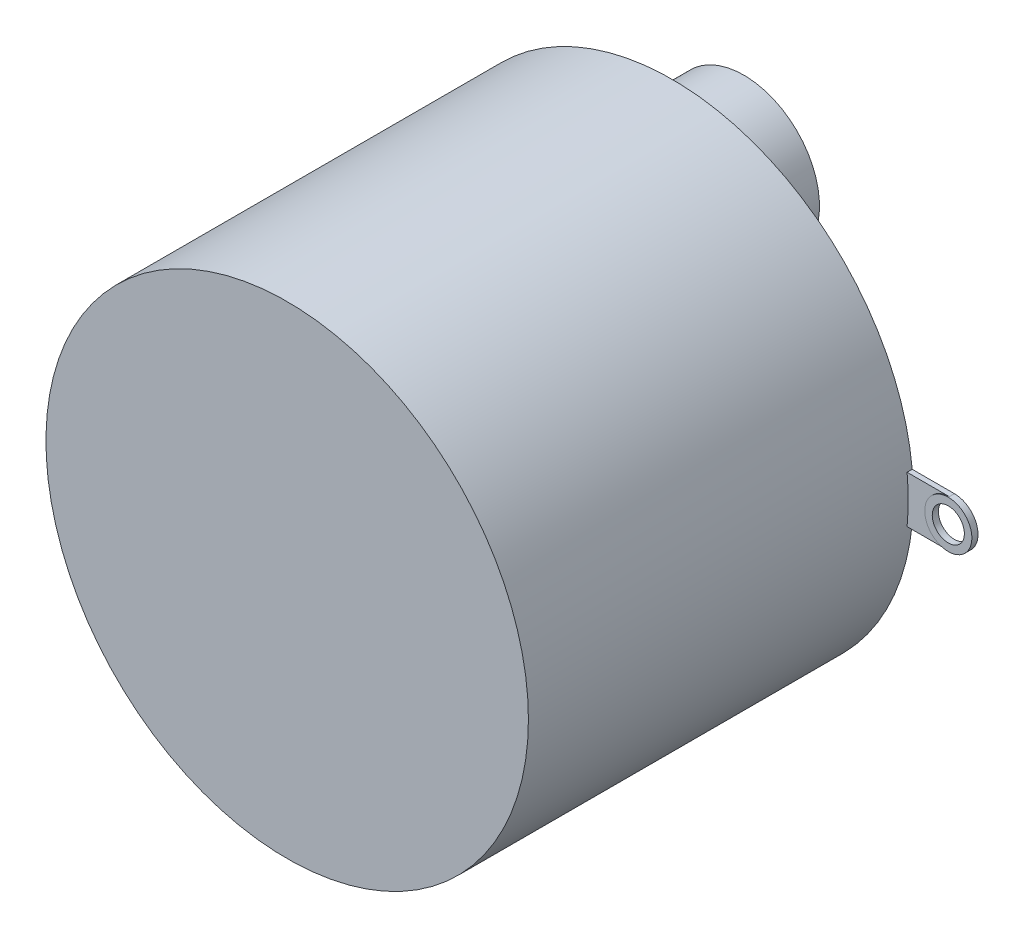
ISO-10303-21;
HEADER;
FILE_DESCRIPTION(('STEP AP214'),'2;1');
FILE_NAME('part.step','',(''),(''),'','','');
FILE_SCHEMA(('AUTOMOTIVE_DESIGN { 1 0 10303 214 1 1 1 1 }'));
ENDSEC;
DATA;
#1=APPLICATION_CONTEXT('core data for automotive mechanical design processes');
#2=APPLICATION_PROTOCOL_DEFINITION('international standard','automotive_design',2000,#1);
#3=PRODUCT_CONTEXT('',#1,'mechanical');
#4=PRODUCT('Part','Part','',(#3));
#5=PRODUCT_RELATED_PRODUCT_CATEGORY('part','',(#4));
#6=PRODUCT_DEFINITION_FORMATION('','',#4);
#7=PRODUCT_DEFINITION_CONTEXT('part definition',#1,'design');
#8=PRODUCT_DEFINITION('design','',#6,#7);
#9=PRODUCT_DEFINITION_SHAPE('','',#8);
#10=(LENGTH_UNIT() NAMED_UNIT(*) SI_UNIT(.MILLI.,.METRE.));
#11=(NAMED_UNIT(*) PLANE_ANGLE_UNIT() SI_UNIT($,.RADIAN.));
#12=(NAMED_UNIT(*) SI_UNIT($,.STERADIAN.) SOLID_ANGLE_UNIT());
#13=UNCERTAINTY_MEASURE_WITH_UNIT(LENGTH_MEASURE(1.E-05),#10,'distance_accuracy_value','');
#14=(GEOMETRIC_REPRESENTATION_CONTEXT(3) GLOBAL_UNCERTAINTY_ASSIGNED_CONTEXT((#13)) GLOBAL_UNIT_ASSIGNED_CONTEXT((#10,
#11,#12)) REPRESENTATION_CONTEXT('',''));
#15=CARTESIAN_POINT('',(0.,0.,0.));
#16=DIRECTION('',(0.,0.,1.));
#17=DIRECTION('',(1.,0.,0.));
#18=AXIS2_PLACEMENT_3D('',#15,#16,#17);
#19=CARTESIAN_POINT('',(0.,0.,19.05));
#20=DIRECTION('',(0.,0.,-1.));
#21=DIRECTION('',(-1.,0.,0.));
#22=AXIS2_PLACEMENT_3D('',#19,#20,#21);
#23=CYLINDRICAL_SURFACE('',#22,11.938);
#24=CARTESIAN_POINT('',(0.,0.,0.253999999999997));
#25=DIRECTION('',(0.,0.,-1.));
#26=DIRECTION('',(-1.,0.,0.));
#27=AXIS2_PLACEMENT_3D('',#24,#25,#26);
#28=CIRCLE('',#27,11.938);
#29=CARTESIAN_POINT('',(11.881000665905,1.1651897599816,0.253999999999997));
#30=VERTEX_POINT('',#29);
#31=CARTESIAN_POINT('',(11.881000665905,-1.1651897599816,0.253999999999997));
#32=VERTEX_POINT('',#31);
#33=EDGE_CURVE('E161',#30,#32,#28,.T.);
#34=ORIENTED_EDGE('',*,*,#33,.F.);
#35=DIRECTION('',(0.,0.,-1.));
#36=VECTOR('',#35,1.);
#37=CARTESIAN_POINT('',(11.881000665905,1.1651897599816,19.05));
#38=LINE('',#37,#36);
#39=CARTESIAN_POINT('',(11.881000665905,1.1651897599816,0.));
#40=VERTEX_POINT('',#39);
#41=EDGE_CURVE('E149',#30,#40,#38,.T.);
#42=ORIENTED_EDGE('',*,*,#41,.T.);
#43=CARTESIAN_POINT('',(0.,0.,0.));
#44=DIRECTION('',(0.,0.,1.));
#45=DIRECTION('',(1.,0.,0.));
#46=AXIS2_PLACEMENT_3D('',#43,#44,#45);
#47=CIRCLE('',#46,11.938);
#48=CARTESIAN_POINT('',(-11.881000665905,1.1651897599816,0.));
#49=VERTEX_POINT('',#48);
#50=EDGE_CURVE('E156',#40,#49,#47,.T.);
#51=ORIENTED_EDGE('',*,*,#50,.T.);
#52=DIRECTION('',(0.,0.,-1.));
#53=VECTOR('',#52,1.);
#54=CARTESIAN_POINT('',(-11.881000665905,1.1651897599816,19.05));
#55=LINE('',#54,#53);
#56=CARTESIAN_POINT('',(-11.881000665905,1.1651897599816,0.253999999999997));
#57=VERTEX_POINT('',#56);
#58=EDGE_CURVE('E146',#49,#57,#55,.F.);
#59=ORIENTED_EDGE('',*,*,#58,.T.);
#60=CARTESIAN_POINT('',(-11.881000665905,-1.1651897599816,0.253999999999997));
#61=VERTEX_POINT('',#60);
#62=EDGE_CURVE('E155',#61,#57,#28,.T.);
#63=ORIENTED_EDGE('',*,*,#62,.F.);
#64=DIRECTION('',(0.,0.,-1.));
#65=VECTOR('',#64,1.);
#66=CARTESIAN_POINT('',(-11.881000665905,-1.1651897599816,19.05));
#67=LINE('',#66,#65);
#68=CARTESIAN_POINT('',(-11.881000665905,-1.1651897599816,0.));
#69=VERTEX_POINT('',#68);
#70=EDGE_CURVE('E144',#61,#69,#67,.T.);
#71=ORIENTED_EDGE('',*,*,#70,.T.);
#72=CARTESIAN_POINT('',(11.881000665905,-1.1651897599816,0.));
#73=VERTEX_POINT('',#72);
#74=EDGE_CURVE('E122',#69,#73,#47,.T.);
#75=ORIENTED_EDGE('',*,*,#74,.T.);
#76=DIRECTION('',(0.,0.,-1.));
#77=VECTOR('',#76,1.);
#78=CARTESIAN_POINT('',(11.881000665905,-1.1651897599816,19.05));
#79=LINE('',#78,#77);
#80=EDGE_CURVE('E59',#73,#32,#79,.F.);
#81=ORIENTED_EDGE('',*,*,#80,.T.);
#82=EDGE_LOOP('',(#34,#42,#51,#59,#63,#71,#75,#81));
#83=FACE_BOUND('',#82,.T.);
#84=CARTESIAN_POINT('',(0.,0.,19.05));
#85=DIRECTION('',(0.,0.,1.));
#86=DIRECTION('',(1.,0.,0.));
#87=AXIS2_PLACEMENT_3D('',#84,#85,#86);
#88=CIRCLE('',#87,11.938);
#89=CARTESIAN_POINT('',(11.938,0.,19.05));
#90=VERTEX_POINT('',#89);
#91=EDGE_CURVE('E152',#90,#90,#88,.T.);
#92=ORIENTED_EDGE('',*,*,#91,.F.);
#93=EDGE_LOOP('',(#92));
#94=FACE_BOUND('',#93,.T.);
#95=ADVANCED_FACE('F37',(#83,#94),#23,.T.);
#96=CARTESIAN_POINT('',(0.,0.,19.05));
#97=DIRECTION('',(0.,0.,1.));
#98=DIRECTION('',(1.,0.,0.));
#99=AXIS2_PLACEMENT_3D('',#96,#97,#98);
#100=PLANE('',#99);
#101=ORIENTED_EDGE('',*,*,#91,.T.);
#102=EDGE_LOOP('',(#101));
#103=FACE_BOUND('',#102,.T.);
#104=ADVANCED_FACE('F213',(#103),#100,.T.);
#105=CARTESIAN_POINT('',(0.,0.,0.));
#106=DIRECTION('',(0.,0.,1.));
#107=DIRECTION('',(1.,0.,0.));
#108=AXIS2_PLACEMENT_3D('',#105,#106,#107);
#109=PLANE('',#108);
#110=CARTESIAN_POINT('',(0.,6.604,0.));
#111=DIRECTION('',(0.,0.,1.));
#112=DIRECTION('',(1.,0.,0.));
#113=AXIS2_PLACEMENT_3D('',#110,#111,#112);
#114=CIRCLE('',#113,0.470774680139313);
#115=CARTESIAN_POINT('',(0.470774680139313,6.604,0.));
#116=VERTEX_POINT('',#115);
#117=EDGE_CURVE('E11',#116,#116,#114,.F.);
#118=ORIENTED_EDGE('',*,*,#117,.F.);
#119=EDGE_LOOP('',(#118));
#120=FACE_BOUND('',#119,.T.);
#121=CARTESIAN_POINT('',(-13.97,0.,0.));
#122=DIRECTION('',(0.,0.,-1.));
#123=DIRECTION('',(-1.,0.,0.));
#124=AXIS2_PLACEMENT_3D('',#121,#122,#123);
#125=CIRCLE('',#124,0.753950062625306);
#126=CARTESIAN_POINT('',(-14.7239500626253,0.,0.));
#127=VERTEX_POINT('',#126);
#128=EDGE_CURVE('E167',#127,#127,#125,.T.);
#129=ORIENTED_EDGE('',*,*,#128,.F.);
#130=EDGE_LOOP('',(#129));
#131=FACE_BOUND('',#130,.T.);
#132=CARTESIAN_POINT('',(13.97,0.,0.));
#133=DIRECTION('',(0.,0.,-1.));
#134=DIRECTION('',(-1.,0.,0.));
#135=AXIS2_PLACEMENT_3D('',#132,#133,#134);
#136=CIRCLE('',#135,0.795236376755501);
#137=CARTESIAN_POINT('',(13.1747636232445,0.,0.));
#138=VERTEX_POINT('',#137);
#139=EDGE_CURVE('E164',#138,#138,#136,.T.);
#140=ORIENTED_EDGE('',*,*,#139,.F.);
#141=EDGE_LOOP('',(#140));
#142=FACE_BOUND('',#141,.T.);
#143=DIRECTION('',(-1.,0.,0.));
#144=VECTOR('',#143,1.);
#145=CARTESIAN_POINT('',(13.97,-1.1651897599816,0.));
#146=LINE('',#145,#144);
#147=CARTESIAN_POINT('',(-13.800047892177,-1.1651897599816,0.));
#148=VERTEX_POINT('',#147);
#149=EDGE_CURVE('E114',#69,#148,#146,.T.);
#150=ORIENTED_EDGE('',*,*,#149,.T.);
#151=CARTESIAN_POINT('',(-13.97,0.,0.));
#152=DIRECTION('',(0.,0.,-1.));
#153=DIRECTION('',(-1.,0.,0.));
#154=AXIS2_PLACEMENT_3D('',#151,#152,#153);
#155=CIRCLE('',#154,1.17751895769006);
#156=CARTESIAN_POINT('',(-13.8000478921769,1.1651897599816,0.));
#157=VERTEX_POINT('',#156);
#158=EDGE_CURVE('E51',#148,#157,#155,.T.);
#159=ORIENTED_EDGE('',*,*,#158,.T.);
#160=DIRECTION('',(1.,0.,0.));
#161=VECTOR('',#160,1.);
#162=CARTESIAN_POINT('',(13.97,1.1651897599816,0.));
#163=LINE('',#162,#161);
#164=EDGE_CURVE('E135',#157,#49,#163,.T.);
#165=ORIENTED_EDGE('',*,*,#164,.T.);
#166=ORIENTED_EDGE('',*,*,#50,.F.);
#167=CARTESIAN_POINT('',(13.97,1.1651897599816,0.));
#168=VERTEX_POINT('',#167);
#169=EDGE_CURVE('E127',#40,#168,#163,.T.);
#170=ORIENTED_EDGE('',*,*,#169,.T.);
#171=CARTESIAN_POINT('',(13.97,0.,0.));
#172=DIRECTION('',(0.,0.,-1.));
#173=DIRECTION('',(-1.,0.,0.));
#174=AXIS2_PLACEMENT_3D('',#171,#172,#173);
#175=CIRCLE('',#174,1.1651897599816);
#176=CARTESIAN_POINT('',(13.97,-1.1651897599816,0.));
#177=VERTEX_POINT('',#176);
#178=EDGE_CURVE('E117',#168,#177,#175,.T.);
#179=ORIENTED_EDGE('',*,*,#178,.T.);
#180=EDGE_CURVE('E124',#177,#73,#146,.T.);
#181=ORIENTED_EDGE('',*,*,#180,.T.);
#182=ORIENTED_EDGE('',*,*,#74,.F.);
#183=EDGE_LOOP('',(#150,#159,#165,#166,#170,#179,#181,#182));
#184=FACE_BOUND('',#183,.T.);
#185=ADVANCED_FACE('F120',(#120,#131,#142,#184),#109,.F.);
#186=CARTESIAN_POINT('',(0.,0.,0.253999999999998));
#187=DIRECTION('',(0.,0.,-1.));
#188=DIRECTION('',(-1.,0.,0.));
#189=AXIS2_PLACEMENT_3D('',#186,#187,#188);
#190=PLANE('',#189);
#191=DIRECTION('',(1.,0.,0.));
#192=VECTOR('',#191,1.);
#193=CARTESIAN_POINT('',(13.97,1.1651897599816,0.253999999999998));
#194=LINE('',#193,#192);
#195=CARTESIAN_POINT('',(-13.8000478921769,1.1651897599816,0.253999999999998));
#196=VERTEX_POINT('',#195);
#197=EDGE_CURVE('E133',#196,#57,#194,.T.);
#198=ORIENTED_EDGE('',*,*,#197,.F.);
#199=CARTESIAN_POINT('',(-13.97,0.,0.253999999999998));
#200=DIRECTION('',(0.,0.,-1.));
#201=DIRECTION('',(-1.,0.,0.));
#202=AXIS2_PLACEMENT_3D('',#199,#200,#201);
#203=CIRCLE('',#202,1.17751895769006);
#204=CARTESIAN_POINT('',(-13.800047892177,-1.1651897599816,0.253999999999998));
#205=VERTEX_POINT('',#204);
#206=EDGE_CURVE('E118',#196,#205,#203,.T.);
#207=ORIENTED_EDGE('',*,*,#206,.T.);
#208=DIRECTION('',(-1.,0.,0.));
#209=VECTOR('',#208,1.);
#210=CARTESIAN_POINT('',(13.97,-1.1651897599816,0.253999999999998));
#211=LINE('',#210,#209);
#212=EDGE_CURVE('E116',#61,#205,#211,.T.);
#213=ORIENTED_EDGE('',*,*,#212,.F.);
#214=ORIENTED_EDGE('',*,*,#62,.T.);
#215=EDGE_LOOP('',(#198,#207,#213,#214));
#216=FACE_BOUND('',#215,.T.);
#217=ADVANCED_FACE('F203',(#216),#190,.F.);
#218=CARTESIAN_POINT('',(13.97,-1.1651897599816,0.253999999999998));
#219=DIRECTION('',(0.,-1.,0.));
#220=DIRECTION('',(0.,0.,-1.));
#221=AXIS2_PLACEMENT_3D('',#218,#219,#220);
#222=PLANE('',#221);
#223=DIRECTION('',(0.,0.,-1.));
#224=VECTOR('',#223,1.);
#225=CARTESIAN_POINT('',(-13.800047892177,-1.1651897599816,0.304204724435391));
#226=LINE('',#225,#224);
#227=EDGE_CURVE('E102',#148,#205,#226,.F.);
#228=ORIENTED_EDGE('',*,*,#227,.F.);
#229=ORIENTED_EDGE('',*,*,#149,.F.);
#230=ORIENTED_EDGE('',*,*,#70,.F.);
#231=ORIENTED_EDGE('',*,*,#212,.T.);
#232=EDGE_LOOP('',(#228,#229,#230,#231));
#233=FACE_BOUND('',#232,.T.);
#234=ADVANCED_FACE('F112',(#233),#222,.T.);
#235=CARTESIAN_POINT('',(13.97,1.1651897599816,0.253999999999998));
#236=DIRECTION('',(0.,1.,0.));
#237=DIRECTION('',(0.,0.,1.));
#238=AXIS2_PLACEMENT_3D('',#235,#236,#237);
#239=PLANE('',#238);
#240=DIRECTION('',(0.,0.,-1.));
#241=VECTOR('',#240,1.);
#242=CARTESIAN_POINT('',(-13.8000478921769,1.1651897599816,0.304204724435391));
#243=LINE('',#242,#241);
#244=EDGE_CURVE('E44',#196,#157,#243,.T.);
#245=ORIENTED_EDGE('',*,*,#244,.F.);
#246=ORIENTED_EDGE('',*,*,#197,.T.);
#247=ORIENTED_EDGE('',*,*,#58,.F.);
#248=ORIENTED_EDGE('',*,*,#164,.F.);
#249=EDGE_LOOP('',(#245,#246,#247,#248));
#250=FACE_BOUND('',#249,.T.);
#251=ADVANCED_FACE('F200',(#250),#239,.T.);
#252=CARTESIAN_POINT('',(13.97,-1.1651897599816,0.253999999999998));
#253=VERTEX_POINT('',#252);
#254=EDGE_CURVE('E187',#253,#32,#211,.T.);
#255=ORIENTED_EDGE('',*,*,#254,.F.);
#256=CARTESIAN_POINT('',(13.97,0.,0.253999999999998));
#257=DIRECTION('',(0.,0.,-1.));
#258=DIRECTION('',(-1.,0.,0.));
#259=AXIS2_PLACEMENT_3D('',#256,#257,#258);
#260=CIRCLE('',#259,1.1651897599816);
#261=CARTESIAN_POINT('',(13.97,1.1651897599816,0.253999999999998));
#262=VERTEX_POINT('',#261);
#263=EDGE_CURVE('E125',#253,#262,#260,.T.);
#264=ORIENTED_EDGE('',*,*,#263,.T.);
#265=EDGE_CURVE('E189',#30,#262,#194,.T.);
#266=ORIENTED_EDGE('',*,*,#265,.F.);
#267=ORIENTED_EDGE('',*,*,#33,.T.);
#268=EDGE_LOOP('',(#255,#264,#266,#267));
#269=FACE_BOUND('',#268,.T.);
#270=ADVANCED_FACE('F206',(#269),#190,.F.);
#271=ORIENTED_EDGE('',*,*,#41,.F.);
#272=ORIENTED_EDGE('',*,*,#265,.T.);
#273=DIRECTION('',(0.,0.,-1.));
#274=VECTOR('',#273,1.);
#275=CARTESIAN_POINT('',(13.97,1.1651897599816,0.253999999999998));
#276=LINE('',#275,#274);
#277=EDGE_CURVE('E137',#262,#168,#276,.T.);
#278=ORIENTED_EDGE('',*,*,#277,.T.);
#279=ORIENTED_EDGE('',*,*,#169,.F.);
#280=EDGE_LOOP('',(#271,#272,#278,#279));
#281=FACE_BOUND('',#280,.T.);
#282=ADVANCED_FACE('F218',(#281),#239,.T.);
#283=ORIENTED_EDGE('',*,*,#80,.F.);
#284=ORIENTED_EDGE('',*,*,#180,.F.);
#285=DIRECTION('',(0.,0.,-1.));
#286=VECTOR('',#285,1.);
#287=CARTESIAN_POINT('',(13.97,-1.1651897599816,0.253999999999998));
#288=LINE('',#287,#286);
#289=EDGE_CURVE('E140',#253,#177,#288,.T.);
#290=ORIENTED_EDGE('',*,*,#289,.F.);
#291=ORIENTED_EDGE('',*,*,#254,.T.);
#292=EDGE_LOOP('',(#283,#284,#290,#291));
#293=FACE_BOUND('',#292,.T.);
#294=ADVANCED_FACE('F212',(#293),#222,.T.);
#295=CARTESIAN_POINT('',(13.97,0.,0.304204724435391));
#296=DIRECTION('',(0.,0.,-1.));
#297=DIRECTION('',(-1.,0.,0.));
#298=AXIS2_PLACEMENT_3D('',#295,#296,#297);
#299=CYLINDRICAL_SURFACE('',#298,1.1651897599816);
#300=CARTESIAN_POINT('',(13.97,0.,0.304204724435391));
#301=DIRECTION('',(0.,0.,-1.));
#302=DIRECTION('',(-1.,0.,0.));
#303=AXIS2_PLACEMENT_3D('',#300,#301,#302);
#304=CIRCLE('',#303,1.1651897599816);
#305=CARTESIAN_POINT('',(12.8048102400184,0.,0.304204724435391));
#306=VERTEX_POINT('',#305);
#307=EDGE_CURVE('E129',#306,#306,#304,.T.);
#308=ORIENTED_EDGE('',*,*,#307,.T.);
#309=EDGE_LOOP('',(#308));
#310=FACE_BOUND('',#309,.T.);
#311=ORIENTED_EDGE('',*,*,#263,.F.);
#312=ORIENTED_EDGE('',*,*,#289,.T.);
#313=ORIENTED_EDGE('',*,*,#178,.F.);
#314=ORIENTED_EDGE('',*,*,#277,.F.);
#315=EDGE_LOOP('',(#311,#312,#313,#314));
#316=FACE_BOUND('',#315,.T.);
#317=ADVANCED_FACE('F232',(#310,#316),#299,.T.);
#318=CARTESIAN_POINT('',(0.,0.,0.304204724435391));
#319=DIRECTION('',(0.,0.,-1.));
#320=DIRECTION('',(-1.,0.,0.));
#321=AXIS2_PLACEMENT_3D('',#318,#319,#320);
#322=PLANE('',#321);
#323=CARTESIAN_POINT('',(13.97,0.,0.304204724435391));
#324=DIRECTION('',(0.,0.,-1.));
#325=DIRECTION('',(-1.,0.,0.));
#326=AXIS2_PLACEMENT_3D('',#323,#324,#325);
#327=CIRCLE('',#326,0.795236376755501);
#328=CARTESIAN_POINT('',(13.1747636232445,0.,0.304204724435391));
#329=VERTEX_POINT('',#328);
#330=EDGE_CURVE('E107',#329,#329,#327,.T.);
#331=ORIENTED_EDGE('',*,*,#330,.T.);
#332=EDGE_LOOP('',(#331));
#333=FACE_BOUND('',#332,.T.);
#334=ORIENTED_EDGE('',*,*,#307,.F.);
#335=EDGE_LOOP('',(#334));
#336=FACE_BOUND('',#335,.T.);
#337=ADVANCED_FACE('F262',(#333,#336),#322,.F.);
#338=CARTESIAN_POINT('',(-13.97,0.,0.304204724435391));
#339=DIRECTION('',(0.,0.,-1.));
#340=DIRECTION('',(-1.,0.,0.));
#341=AXIS2_PLACEMENT_3D('',#338,#339,#340);
#342=CYLINDRICAL_SURFACE('',#341,1.17751895769006);
#343=ORIENTED_EDGE('',*,*,#244,.T.);
#344=ORIENTED_EDGE('',*,*,#158,.F.);
#345=ORIENTED_EDGE('',*,*,#227,.T.);
#346=ORIENTED_EDGE('',*,*,#206,.F.);
#347=EDGE_LOOP('',(#343,#344,#345,#346));
#348=FACE_BOUND('',#347,.T.);
#349=CARTESIAN_POINT('',(-13.97,0.,0.304204724435391));
#350=DIRECTION('',(0.,0.,-1.));
#351=DIRECTION('',(-1.,0.,0.));
#352=AXIS2_PLACEMENT_3D('',#349,#350,#351);
#353=CIRCLE('',#352,1.17751895769006);
#354=CARTESIAN_POINT('',(-15.1475189576901,0.,0.304204724435391));
#355=VERTEX_POINT('',#354);
#356=EDGE_CURVE('E106',#355,#355,#353,.T.);
#357=ORIENTED_EDGE('',*,*,#356,.T.);
#358=EDGE_LOOP('',(#357));
#359=FACE_BOUND('',#358,.T.);
#360=ADVANCED_FACE('F100',(#348,#359),#342,.T.);
#361=CARTESIAN_POINT('',(0.,0.,0.304204724435391));
#362=DIRECTION('',(0.,0.,-1.));
#363=DIRECTION('',(-1.,0.,0.));
#364=AXIS2_PLACEMENT_3D('',#361,#362,#363);
#365=PLANE('',#364);
#366=CARTESIAN_POINT('',(-13.97,0.,0.304204724435391));
#367=DIRECTION('',(0.,0.,-1.));
#368=DIRECTION('',(-1.,0.,0.));
#369=AXIS2_PLACEMENT_3D('',#366,#367,#368);
#370=CIRCLE('',#369,0.753950062625306);
#371=CARTESIAN_POINT('',(-14.7239500626253,0.,0.304204724435391));
#372=VERTEX_POINT('',#371);
#373=EDGE_CURVE('E165',#372,#372,#370,.T.);
#374=ORIENTED_EDGE('',*,*,#373,.T.);
#375=EDGE_LOOP('',(#374));
#376=FACE_BOUND('',#375,.T.);
#377=ORIENTED_EDGE('',*,*,#356,.F.);
#378=EDGE_LOOP('',(#377));
#379=FACE_BOUND('',#378,.T.);
#380=ADVANCED_FACE('F274',(#376,#379),#365,.F.);
#381=CARTESIAN_POINT('',(13.97,0.,0.90572007352387));
#382=DIRECTION('',(0.,0.,-1.));
#383=DIRECTION('',(-1.,0.,0.));
#384=AXIS2_PLACEMENT_3D('',#381,#382,#383);
#385=CYLINDRICAL_SURFACE('',#384,0.795236376755501);
#386=ORIENTED_EDGE('',*,*,#139,.T.);
#387=EDGE_LOOP('',(#386));
#388=FACE_BOUND('',#387,.T.);
#389=ORIENTED_EDGE('',*,*,#330,.F.);
#390=EDGE_LOOP('',(#389));
#391=FACE_BOUND('',#390,.T.);
#392=ADVANCED_FACE('F289',(#388,#391),#385,.F.);
#393=CARTESIAN_POINT('',(-13.97,0.,1.016));
#394=DIRECTION('',(0.,0.,-1.));
#395=DIRECTION('',(-1.,0.,0.));
#396=AXIS2_PLACEMENT_3D('',#393,#394,#395);
#397=CYLINDRICAL_SURFACE('',#396,0.753950062625306);
#398=ORIENTED_EDGE('',*,*,#128,.T.);
#399=EDGE_LOOP('',(#398));
#400=FACE_BOUND('',#399,.T.);
#401=ORIENTED_EDGE('',*,*,#373,.F.);
#402=EDGE_LOOP('',(#401));
#403=FACE_BOUND('',#402,.T.);
#404=ADVANCED_FACE('F293',(#400,#403),#397,.F.);
#405=CARTESIAN_POINT('',(0.,6.604,-0.245031324178737));
#406=DIRECTION('',(0.,0.,1.));
#407=DIRECTION('',(1.,0.,0.));
#408=AXIS2_PLACEMENT_3D('',#405,#406,#407);
#409=CYLINDRICAL_SURFACE('',#408,0.470774680139313);
#410=CARTESIAN_POINT('',(0.,6.604,-0.245031324178737));
#411=DIRECTION('',(0.,0.,-1.));
#412=DIRECTION('',(-1.,0.,0.));
#413=AXIS2_PLACEMENT_3D('',#410,#411,#412);
#414=CIRCLE('',#413,0.470774680139313);
#415=CARTESIAN_POINT('',(-0.470774680139313,6.604,-0.245031324178737));
#416=VERTEX_POINT('',#415);
#417=EDGE_CURVE('E173',#416,#416,#414,.T.);
#418=ORIENTED_EDGE('',*,*,#417,.F.);
#419=EDGE_LOOP('',(#418));
#420=FACE_BOUND('',#419,.T.);
#421=ORIENTED_EDGE('',*,*,#117,.T.);
#422=EDGE_LOOP('',(#421));
#423=FACE_BOUND('',#422,.T.);
#424=ADVANCED_FACE('F310',(#420,#423),#409,.T.);
#425=CARTESIAN_POINT('',(0.,6.604,-3.54703132417874));
#426=DIRECTION('',(0.,0.,1.));
#427=DIRECTION('',(1.,0.,0.));
#428=AXIS2_PLACEMENT_3D('',#425,#426,#427);
#429=CYLINDRICAL_SURFACE('',#428,3.7431615780602);
#430=CARTESIAN_POINT('',(0.,6.604,-3.54703132417874));
#431=DIRECTION('',(0.,0.,-1.));
#432=DIRECTION('',(-1.,0.,0.));
#433=AXIS2_PLACEMENT_3D('',#430,#431,#432);
#434=CIRCLE('',#433,3.7431615780602);
#435=CARTESIAN_POINT('',(-3.7431615780602,6.604,-3.54703132417874));
#436=VERTEX_POINT('',#435);
#437=EDGE_CURVE('E178',#436,#436,#434,.T.);
#438=ORIENTED_EDGE('',*,*,#437,.F.);
#439=EDGE_LOOP('',(#438));
#440=FACE_BOUND('',#439,.T.);
#441=CARTESIAN_POINT('',(0.,6.604,-0.245031324178737));
#442=DIRECTION('',(0.,0.,-1.));
#443=DIRECTION('',(-1.,0.,0.));
#444=AXIS2_PLACEMENT_3D('',#441,#442,#443);
#445=CIRCLE('',#444,3.7431615780602);
#446=CARTESIAN_POINT('',(-3.7431615780602,6.604,-0.245031324178737));
#447=VERTEX_POINT('',#446);
#448=EDGE_CURVE('E364',#447,#447,#445,.T.);
#449=ORIENTED_EDGE('',*,*,#448,.T.);
#450=EDGE_LOOP('',(#449));
#451=FACE_BOUND('',#450,.T.);
#452=ADVANCED_FACE('F326',(#440,#451),#429,.T.);
#453=CARTESIAN_POINT('',(0.,6.604,-3.54703132417874));
#454=DIRECTION('',(0.,0.,-1.));
#455=DIRECTION('',(-1.,0.,0.));
#456=AXIS2_PLACEMENT_3D('',#453,#454,#455);
#457=PLANE('',#456);
#458=ORIENTED_EDGE('',*,*,#437,.T.);
#459=EDGE_LOOP('',(#458));
#460=FACE_BOUND('',#459,.T.);
#461=ADVANCED_FACE('F336',(#460),#457,.T.);
#462=CARTESIAN_POINT('',(0.,6.604,-0.245031324178737));
#463=DIRECTION('',(0.,0.,-1.));
#464=DIRECTION('',(-1.,0.,0.));
#465=AXIS2_PLACEMENT_3D('',#462,#463,#464);
#466=PLANE('',#465);
#467=ORIENTED_EDGE('',*,*,#417,.T.);
#468=EDGE_LOOP('',(#467));
#469=FACE_BOUND('',#468,.T.);
#470=ORIENTED_EDGE('',*,*,#448,.F.);
#471=EDGE_LOOP('',(#470));
#472=FACE_BOUND('',#471,.T.);
#473=ADVANCED_FACE('F346',(#469,#472),#466,.F.);
#474=CLOSED_SHELL('',(#95,#104,#185,#217,#234,#251,#270,#282,#294,#317,#337,#360,#380,#392,#404,
#424,#452,#461,#473));
#475=MANIFOLD_SOLID_BREP('B2',#474);
#476=ADVANCED_BREP_SHAPE_REPRESENTATION('',(#18,#475),#14);
#477=SHAPE_DEFINITION_REPRESENTATION(#9,#476);
ENDSEC;
END-ISO-10303-21;
